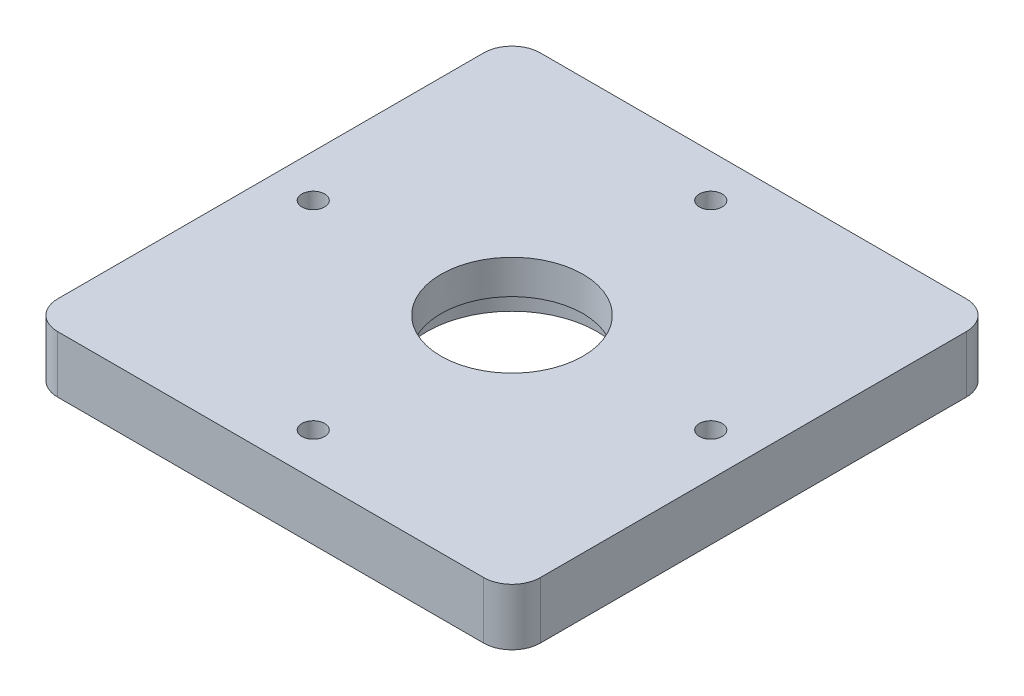
ISO-10303-21;
HEADER;
FILE_DESCRIPTION(('STEP AP214'),'2;1');
FILE_NAME('part.step','',(''),(''),'','','');
FILE_SCHEMA(('AUTOMOTIVE_DESIGN { 1 0 10303 214 1 1 1 1 }'));
ENDSEC;
DATA;
#1=APPLICATION_CONTEXT('core data for automotive mechanical design processes');
#2=APPLICATION_PROTOCOL_DEFINITION('international standard','automotive_design',2000,#1);
#3=PRODUCT_CONTEXT('',#1,'mechanical');
#4=PRODUCT('Part','Part','',(#3));
#5=PRODUCT_RELATED_PRODUCT_CATEGORY('part','',(#4));
#6=PRODUCT_DEFINITION_FORMATION('','',#4);
#7=PRODUCT_DEFINITION_CONTEXT('part definition',#1,'design');
#8=PRODUCT_DEFINITION('design','',#6,#7);
#9=PRODUCT_DEFINITION_SHAPE('','',#8);
#10=(LENGTH_UNIT() NAMED_UNIT(*) SI_UNIT(.MILLI.,.METRE.));
#11=(NAMED_UNIT(*) PLANE_ANGLE_UNIT() SI_UNIT($,.RADIAN.));
#12=(NAMED_UNIT(*) SI_UNIT($,.STERADIAN.) SOLID_ANGLE_UNIT());
#13=UNCERTAINTY_MEASURE_WITH_UNIT(LENGTH_MEASURE(1.E-05),#10,'distance_accuracy_value','');
#14=(GEOMETRIC_REPRESENTATION_CONTEXT(3) GLOBAL_UNCERTAINTY_ASSIGNED_CONTEXT((#13)) GLOBAL_UNIT_ASSIGNED_CONTEXT((#10,
#11,#12)) REPRESENTATION_CONTEXT('',''));
#15=CARTESIAN_POINT('',(0.,0.,0.));
#16=DIRECTION('',(0.,0.,1.));
#17=DIRECTION('',(1.,0.,0.));
#18=AXIS2_PLACEMENT_3D('',#15,#16,#17);
#19=CARTESIAN_POINT('',(85.,20.,-85.));
#20=DIRECTION('',(-1.,0.,0.));
#21=DIRECTION('',(0.,0.,1.));
#22=AXIS2_PLACEMENT_3D('',#19,#20,#21);
#23=PLANE('',#22);
#24=DIRECTION('',(0.,0.,-1.));
#25=VECTOR('',#24,1.);
#26=CARTESIAN_POINT('',(85.,0.,-85.));
#27=LINE('',#26,#25);
#28=CARTESIAN_POINT('',(85.,0.,75.));
#29=VERTEX_POINT('',#28);
#30=CARTESIAN_POINT('',(85.,0.,-75.));
#31=VERTEX_POINT('',#30);
#32=EDGE_CURVE('E123',#29,#31,#27,.T.);
#33=ORIENTED_EDGE('',*,*,#32,.T.);
#34=DIRECTION('',(0.,-1.,0.));
#35=VECTOR('',#34,1.);
#36=CARTESIAN_POINT('',(85.,20.,-75.));
#37=LINE('',#36,#35);
#38=CARTESIAN_POINT('',(85.,20.,-75.));
#39=VERTEX_POINT('',#38);
#40=EDGE_CURVE('E165',#31,#39,#37,.F.);
#41=ORIENTED_EDGE('',*,*,#40,.T.);
#42=DIRECTION('',(0.,0.,-1.));
#43=VECTOR('',#42,1.);
#44=CARTESIAN_POINT('',(85.,20.,-85.));
#45=LINE('',#44,#43);
#46=CARTESIAN_POINT('',(85.,20.,75.));
#47=VERTEX_POINT('',#46);
#48=EDGE_CURVE('E126',#47,#39,#45,.T.);
#49=ORIENTED_EDGE('',*,*,#48,.F.);
#50=DIRECTION('',(0.,-1.,0.));
#51=VECTOR('',#50,1.);
#52=CARTESIAN_POINT('',(85.,20.,75.));
#53=LINE('',#52,#51);
#54=EDGE_CURVE('E114',#47,#29,#53,.T.);
#55=ORIENTED_EDGE('',*,*,#54,.T.);
#56=EDGE_LOOP('',(#33,#41,#49,#55));
#57=FACE_BOUND('',#56,.T.);
#58=ADVANCED_FACE('F42',(#57),#23,.F.);
#59=CARTESIAN_POINT('',(-85.,20.,-85.));
#60=DIRECTION('',(0.,0.,1.));
#61=DIRECTION('',(1.,0.,0.));
#62=AXIS2_PLACEMENT_3D('',#59,#60,#61);
#63=PLANE('',#62);
#64=DIRECTION('',(-1.,0.,0.));
#65=VECTOR('',#64,1.);
#66=CARTESIAN_POINT('',(-85.,0.,-85.));
#67=LINE('',#66,#65);
#68=CARTESIAN_POINT('',(75.,0.,-85.));
#69=VERTEX_POINT('',#68);
#70=CARTESIAN_POINT('',(-75.,0.,-85.));
#71=VERTEX_POINT('',#70);
#72=EDGE_CURVE('E134',#69,#71,#67,.T.);
#73=ORIENTED_EDGE('',*,*,#72,.T.);
#74=DIRECTION('',(0.,-1.,0.));
#75=VECTOR('',#74,1.);
#76=CARTESIAN_POINT('',(-75.,20.,-85.));
#77=LINE('',#76,#75);
#78=CARTESIAN_POINT('',(-75.,20.,-85.));
#79=VERTEX_POINT('',#78);
#80=EDGE_CURVE('E178',#71,#79,#77,.F.);
#81=ORIENTED_EDGE('',*,*,#80,.T.);
#82=DIRECTION('',(-1.,0.,0.));
#83=VECTOR('',#82,1.);
#84=CARTESIAN_POINT('',(-85.,20.,-85.));
#85=LINE('',#84,#83);
#86=CARTESIAN_POINT('',(75.,20.,-85.));
#87=VERTEX_POINT('',#86);
#88=EDGE_CURVE('E213',#87,#79,#85,.T.);
#89=ORIENTED_EDGE('',*,*,#88,.F.);
#90=DIRECTION('',(0.,-1.,0.));
#91=VECTOR('',#90,1.);
#92=CARTESIAN_POINT('',(75.,20.,-85.));
#93=LINE('',#92,#91);
#94=EDGE_CURVE('E159',#87,#69,#93,.T.);
#95=ORIENTED_EDGE('',*,*,#94,.T.);
#96=EDGE_LOOP('',(#73,#81,#89,#95));
#97=FACE_BOUND('',#96,.T.);
#98=ADVANCED_FACE('F327',(#97),#63,.F.);
#99=CARTESIAN_POINT('',(-85.,20.,-85.));
#100=DIRECTION('',(1.,0.,0.));
#101=DIRECTION('',(0.,0.,-1.));
#102=AXIS2_PLACEMENT_3D('',#99,#100,#101);
#103=PLANE('',#102);
#104=DIRECTION('',(0.,0.,1.));
#105=VECTOR('',#104,1.);
#106=CARTESIAN_POINT('',(-85.,0.,-85.));
#107=LINE('',#106,#105);
#108=CARTESIAN_POINT('',(-85.,0.,-75.));
#109=VERTEX_POINT('',#108);
#110=CARTESIAN_POINT('',(-85.,0.,75.));
#111=VERTEX_POINT('',#110);
#112=EDGE_CURVE('E141',#109,#111,#107,.T.);
#113=ORIENTED_EDGE('',*,*,#112,.T.);
#114=DIRECTION('',(0.,-1.,0.));
#115=VECTOR('',#114,1.);
#116=CARTESIAN_POINT('',(-85.,20.,75.));
#117=LINE('',#116,#115);
#118=CARTESIAN_POINT('',(-85.,20.,75.));
#119=VERTEX_POINT('',#118);
#120=EDGE_CURVE('E52',#111,#119,#117,.F.);
#121=ORIENTED_EDGE('',*,*,#120,.T.);
#122=DIRECTION('',(0.,0.,1.));
#123=VECTOR('',#122,1.);
#124=CARTESIAN_POINT('',(-85.,20.,-85.));
#125=LINE('',#124,#123);
#126=CARTESIAN_POINT('',(-85.,20.,-75.));
#127=VERTEX_POINT('',#126);
#128=EDGE_CURVE('E210',#127,#119,#125,.T.);
#129=ORIENTED_EDGE('',*,*,#128,.F.);
#130=DIRECTION('',(0.,-1.,0.));
#131=VECTOR('',#130,1.);
#132=CARTESIAN_POINT('',(-85.,20.,-75.));
#133=LINE('',#132,#131);
#134=EDGE_CURVE('E171',#127,#109,#133,.T.);
#135=ORIENTED_EDGE('',*,*,#134,.T.);
#136=EDGE_LOOP('',(#113,#121,#129,#135));
#137=FACE_BOUND('',#136,.T.);
#138=ADVANCED_FACE('F322',(#137),#103,.F.);
#139=CARTESIAN_POINT('',(-85.,20.,85.));
#140=DIRECTION('',(0.,0.,-1.));
#141=DIRECTION('',(-1.,0.,0.));
#142=AXIS2_PLACEMENT_3D('',#139,#140,#141);
#143=PLANE('',#142);
#144=DIRECTION('',(1.,0.,0.));
#145=VECTOR('',#144,1.);
#146=CARTESIAN_POINT('',(-85.,20.,85.));
#147=LINE('',#146,#145);
#148=CARTESIAN_POINT('',(-75.,20.,85.));
#149=VERTEX_POINT('',#148);
#150=CARTESIAN_POINT('',(75.,20.,85.));
#151=VERTEX_POINT('',#150);
#152=EDGE_CURVE('E128',#149,#151,#147,.T.);
#153=ORIENTED_EDGE('',*,*,#152,.F.);
#154=DIRECTION('',(0.,-1.,0.));
#155=VECTOR('',#154,1.);
#156=CARTESIAN_POINT('',(-75.,20.,85.));
#157=LINE('',#156,#155);
#158=CARTESIAN_POINT('',(-75.,0.,85.));
#159=VERTEX_POINT('',#158);
#160=EDGE_CURVE('E184',#149,#159,#157,.T.);
#161=ORIENTED_EDGE('',*,*,#160,.T.);
#162=DIRECTION('',(1.,0.,0.));
#163=VECTOR('',#162,1.);
#164=CARTESIAN_POINT('',(-85.,0.,85.));
#165=LINE('',#164,#163);
#166=CARTESIAN_POINT('',(75.,0.,85.));
#167=VERTEX_POINT('',#166);
#168=EDGE_CURVE('E151',#159,#167,#165,.T.);
#169=ORIENTED_EDGE('',*,*,#168,.T.);
#170=DIRECTION('',(0.,-1.,0.));
#171=VECTOR('',#170,1.);
#172=CARTESIAN_POINT('',(75.,20.,85.));
#173=LINE('',#172,#171);
#174=EDGE_CURVE('E116',#167,#151,#173,.F.);
#175=ORIENTED_EDGE('',*,*,#174,.T.);
#176=EDGE_LOOP('',(#153,#161,#169,#175));
#177=FACE_BOUND('',#176,.T.);
#178=ADVANCED_FACE('F304',(#177),#143,.F.);
#179=CARTESIAN_POINT('',(0.,20.,0.));
#180=DIRECTION('',(0.,1.,0.));
#181=DIRECTION('',(0.,0.,1.));
#182=AXIS2_PLACEMENT_3D('',#179,#180,#181);
#183=PLANE('',#182);
#184=CARTESIAN_POINT('',(0.,20.,-70.));
#185=DIRECTION('',(0.,1.,0.));
#186=DIRECTION('',(0.,0.,1.));
#187=AXIS2_PLACEMENT_3D('',#184,#185,#186);
#188=CIRCLE('',#187,4.);
#189=CARTESIAN_POINT('',(0.,20.,-66.));
#190=VERTEX_POINT('',#189);
#191=EDGE_CURVE('E293',#190,#190,#188,.T.);
#192=ORIENTED_EDGE('',*,*,#191,.F.);
#193=EDGE_LOOP('',(#192));
#194=FACE_BOUND('',#193,.T.);
#195=CARTESIAN_POINT('',(0.,20.,70.));
#196=DIRECTION('',(0.,1.,0.));
#197=DIRECTION('',(0.,0.,1.));
#198=AXIS2_PLACEMENT_3D('',#195,#196,#197);
#199=CIRCLE('',#198,4.);
#200=CARTESIAN_POINT('',(0.,20.,74.));
#201=VERTEX_POINT('',#200);
#202=EDGE_CURVE('E277',#201,#201,#199,.T.);
#203=ORIENTED_EDGE('',*,*,#202,.F.);
#204=EDGE_LOOP('',(#203));
#205=FACE_BOUND('',#204,.T.);
#206=CARTESIAN_POINT('',(70.,20.,0.));
#207=DIRECTION('',(0.,1.,0.));
#208=DIRECTION('',(0.,0.,1.));
#209=AXIS2_PLACEMENT_3D('',#206,#207,#208);
#210=CIRCLE('',#209,4.);
#211=CARTESIAN_POINT('',(70.,20.,4.));
#212=VERTEX_POINT('',#211);
#213=EDGE_CURVE('E261',#212,#212,#210,.T.);
#214=ORIENTED_EDGE('',*,*,#213,.F.);
#215=EDGE_LOOP('',(#214));
#216=FACE_BOUND('',#215,.T.);
#217=CARTESIAN_POINT('',(-70.,20.,0.));
#218=DIRECTION('',(0.,1.,0.));
#219=DIRECTION('',(0.,0.,1.));
#220=AXIS2_PLACEMENT_3D('',#217,#218,#219);
#221=CIRCLE('',#220,4.);
#222=CARTESIAN_POINT('',(-70.,20.,4.));
#223=VERTEX_POINT('',#222);
#224=EDGE_CURVE('E245',#223,#223,#221,.T.);
#225=ORIENTED_EDGE('',*,*,#224,.F.);
#226=EDGE_LOOP('',(#225));
#227=FACE_BOUND('',#226,.T.);
#228=CARTESIAN_POINT('',(0.,20.,0.));
#229=DIRECTION('',(0.,1.,0.));
#230=DIRECTION('',(0.,0.,1.));
#231=AXIS2_PLACEMENT_3D('',#228,#229,#230);
#232=CIRCLE('',#231,25.);
#233=CARTESIAN_POINT('',(0.,20.,25.));
#234=VERTEX_POINT('',#233);
#235=EDGE_CURVE('E46',#234,#234,#232,.T.);
#236=ORIENTED_EDGE('',*,*,#235,.F.);
#237=EDGE_LOOP('',(#236));
#238=FACE_BOUND('',#237,.T.);
#239=ORIENTED_EDGE('',*,*,#128,.T.);
#240=CARTESIAN_POINT('',(-75.,20.,75.));
#241=DIRECTION('',(0.,1.,0.));
#242=DIRECTION('',(0.,0.,1.));
#243=AXIS2_PLACEMENT_3D('',#240,#241,#242);
#244=CIRCLE('',#243,10.);
#245=EDGE_CURVE('E11',#119,#149,#244,.T.);
#246=ORIENTED_EDGE('',*,*,#245,.T.);
#247=ORIENTED_EDGE('',*,*,#152,.T.);
#248=CARTESIAN_POINT('',(75.,20.,75.));
#249=DIRECTION('',(0.,1.,0.));
#250=DIRECTION('',(0.,0.,1.));
#251=AXIS2_PLACEMENT_3D('',#248,#249,#250);
#252=CIRCLE('',#251,10.);
#253=EDGE_CURVE('E156',#151,#47,#252,.T.);
#254=ORIENTED_EDGE('',*,*,#253,.T.);
#255=ORIENTED_EDGE('',*,*,#48,.T.);
#256=CARTESIAN_POINT('',(75.,20.,-75.));
#257=DIRECTION('',(0.,1.,0.));
#258=DIRECTION('',(0.,0.,1.));
#259=AXIS2_PLACEMENT_3D('',#256,#257,#258);
#260=CIRCLE('',#259,10.);
#261=EDGE_CURVE('E168',#39,#87,#260,.T.);
#262=ORIENTED_EDGE('',*,*,#261,.T.);
#263=ORIENTED_EDGE('',*,*,#88,.T.);
#264=CARTESIAN_POINT('',(-75.,20.,-75.));
#265=DIRECTION('',(0.,1.,0.));
#266=DIRECTION('',(0.,0.,1.));
#267=AXIS2_PLACEMENT_3D('',#264,#265,#266);
#268=CIRCLE('',#267,10.);
#269=EDGE_CURVE('E181',#79,#127,#268,.T.);
#270=ORIENTED_EDGE('',*,*,#269,.T.);
#271=EDGE_LOOP('',(#239,#246,#247,#254,#255,#262,#263,#270));
#272=FACE_BOUND('',#271,.T.);
#273=ADVANCED_FACE('F301',(#194,#205,#216,#227,#238,#272),#183,.T.);
#274=CARTESIAN_POINT('',(0.,0.,0.));
#275=DIRECTION('',(0.,1.,0.));
#276=DIRECTION('',(0.,0.,1.));
#277=AXIS2_PLACEMENT_3D('',#274,#275,#276);
#278=PLANE('',#277);
#279=CARTESIAN_POINT('',(0.,0.,-70.));
#280=DIRECTION('',(0.,1.,0.));
#281=DIRECTION('',(0.,0.,1.));
#282=AXIS2_PLACEMENT_3D('',#279,#280,#281);
#283=CIRCLE('',#282,3.);
#284=CARTESIAN_POINT('',(0.,0.,-67.));
#285=VERTEX_POINT('',#284);
#286=EDGE_CURVE('E281',#285,#285,#283,.T.);
#287=ORIENTED_EDGE('',*,*,#286,.T.);
#288=EDGE_LOOP('',(#287));
#289=FACE_BOUND('',#288,.T.);
#290=CARTESIAN_POINT('',(0.,0.,70.));
#291=DIRECTION('',(0.,1.,0.));
#292=DIRECTION('',(0.,0.,1.));
#293=AXIS2_PLACEMENT_3D('',#290,#291,#292);
#294=CIRCLE('',#293,3.);
#295=CARTESIAN_POINT('',(0.,0.,73.));
#296=VERTEX_POINT('',#295);
#297=EDGE_CURVE('E265',#296,#296,#294,.T.);
#298=ORIENTED_EDGE('',*,*,#297,.T.);
#299=EDGE_LOOP('',(#298));
#300=FACE_BOUND('',#299,.T.);
#301=CARTESIAN_POINT('',(70.,0.,0.));
#302=DIRECTION('',(0.,1.,0.));
#303=DIRECTION('',(0.,0.,1.));
#304=AXIS2_PLACEMENT_3D('',#301,#302,#303);
#305=CIRCLE('',#304,2.99999999999999);
#306=CARTESIAN_POINT('',(70.,0.,2.99999999999999));
#307=VERTEX_POINT('',#306);
#308=EDGE_CURVE('E249',#307,#307,#305,.T.);
#309=ORIENTED_EDGE('',*,*,#308,.T.);
#310=EDGE_LOOP('',(#309));
#311=FACE_BOUND('',#310,.T.);
#312=CARTESIAN_POINT('',(-70.,0.,0.));
#313=DIRECTION('',(0.,1.,0.));
#314=DIRECTION('',(0.,0.,1.));
#315=AXIS2_PLACEMENT_3D('',#312,#313,#314);
#316=CIRCLE('',#315,2.99999999999999);
#317=CARTESIAN_POINT('',(-70.,0.,2.99999999999999));
#318=VERTEX_POINT('',#317);
#319=EDGE_CURVE('E233',#318,#318,#316,.T.);
#320=ORIENTED_EDGE('',*,*,#319,.T.);
#321=EDGE_LOOP('',(#320));
#322=FACE_BOUND('',#321,.T.);
#323=CARTESIAN_POINT('',(0.,0.,0.));
#324=DIRECTION('',(0.,-1.,0.));
#325=DIRECTION('',(0.,0.,-1.));
#326=AXIS2_PLACEMENT_3D('',#323,#324,#325);
#327=CIRCLE('',#326,30.);
#328=CARTESIAN_POINT('',(0.,0.,-30.));
#329=VERTEX_POINT('',#328);
#330=EDGE_CURVE('E144',#329,#329,#327,.T.);
#331=ORIENTED_EDGE('',*,*,#330,.F.);
#332=EDGE_LOOP('',(#331));
#333=FACE_BOUND('',#332,.T.);
#334=ORIENTED_EDGE('',*,*,#168,.F.);
#335=CARTESIAN_POINT('',(-75.,0.,75.));
#336=DIRECTION('',(0.,1.,0.));
#337=DIRECTION('',(0.,0.,1.));
#338=AXIS2_PLACEMENT_3D('',#335,#336,#337);
#339=CIRCLE('',#338,10.);
#340=EDGE_CURVE('E66',#159,#111,#339,.F.);
#341=ORIENTED_EDGE('',*,*,#340,.T.);
#342=ORIENTED_EDGE('',*,*,#112,.F.);
#343=CARTESIAN_POINT('',(-75.,0.,-75.));
#344=DIRECTION('',(0.,1.,0.));
#345=DIRECTION('',(0.,0.,1.));
#346=AXIS2_PLACEMENT_3D('',#343,#344,#345);
#347=CIRCLE('',#346,10.);
#348=EDGE_CURVE('E175',#109,#71,#347,.F.);
#349=ORIENTED_EDGE('',*,*,#348,.T.);
#350=ORIENTED_EDGE('',*,*,#72,.F.);
#351=CARTESIAN_POINT('',(75.,0.,-75.));
#352=DIRECTION('',(0.,1.,0.));
#353=DIRECTION('',(0.,0.,1.));
#354=AXIS2_PLACEMENT_3D('',#351,#352,#353);
#355=CIRCLE('',#354,10.);
#356=EDGE_CURVE('E132',#69,#31,#355,.F.);
#357=ORIENTED_EDGE('',*,*,#356,.T.);
#358=ORIENTED_EDGE('',*,*,#32,.F.);
#359=CARTESIAN_POINT('',(75.,0.,75.));
#360=DIRECTION('',(0.,1.,0.));
#361=DIRECTION('',(0.,0.,1.));
#362=AXIS2_PLACEMENT_3D('',#359,#360,#361);
#363=CIRCLE('',#362,10.);
#364=EDGE_CURVE('E110',#29,#167,#363,.F.);
#365=ORIENTED_EDGE('',*,*,#364,.T.);
#366=EDGE_LOOP('',(#334,#341,#342,#349,#350,#357,#358,#365));
#367=FACE_BOUND('',#366,.T.);
#368=ADVANCED_FACE('F130',(#289,#300,#311,#322,#333,#367),#278,.F.);
#369=CARTESIAN_POINT('',(75.,20.,75.));
#370=DIRECTION('',(0.,-1.,0.));
#371=DIRECTION('',(0.,0.,-1.));
#372=AXIS2_PLACEMENT_3D('',#369,#370,#371);
#373=CYLINDRICAL_SURFACE('',#372,10.);
#374=ORIENTED_EDGE('',*,*,#253,.F.);
#375=ORIENTED_EDGE('',*,*,#174,.F.);
#376=ORIENTED_EDGE('',*,*,#364,.F.);
#377=ORIENTED_EDGE('',*,*,#54,.F.);
#378=EDGE_LOOP('',(#374,#375,#376,#377));
#379=FACE_BOUND('',#378,.T.);
#380=ADVANCED_FACE('F113',(#379),#373,.T.);
#381=CARTESIAN_POINT('',(75.,20.,-75.));
#382=DIRECTION('',(0.,-1.,0.));
#383=DIRECTION('',(0.,0.,-1.));
#384=AXIS2_PLACEMENT_3D('',#381,#382,#383);
#385=CYLINDRICAL_SURFACE('',#384,10.);
#386=ORIENTED_EDGE('',*,*,#261,.F.);
#387=ORIENTED_EDGE('',*,*,#40,.F.);
#388=ORIENTED_EDGE('',*,*,#356,.F.);
#389=ORIENTED_EDGE('',*,*,#94,.F.);
#390=EDGE_LOOP('',(#386,#387,#388,#389));
#391=FACE_BOUND('',#390,.T.);
#392=ADVANCED_FACE('F340',(#391),#385,.T.);
#393=CARTESIAN_POINT('',(-75.,20.,-75.));
#394=DIRECTION('',(0.,-1.,0.));
#395=DIRECTION('',(0.,0.,-1.));
#396=AXIS2_PLACEMENT_3D('',#393,#394,#395);
#397=CYLINDRICAL_SURFACE('',#396,10.);
#398=ORIENTED_EDGE('',*,*,#269,.F.);
#399=ORIENTED_EDGE('',*,*,#80,.F.);
#400=ORIENTED_EDGE('',*,*,#348,.F.);
#401=ORIENTED_EDGE('',*,*,#134,.F.);
#402=EDGE_LOOP('',(#398,#399,#400,#401));
#403=FACE_BOUND('',#402,.T.);
#404=ADVANCED_FACE('F342',(#403),#397,.T.);
#405=CARTESIAN_POINT('',(-75.,20.,75.));
#406=DIRECTION('',(0.,-1.,0.));
#407=DIRECTION('',(0.,0.,-1.));
#408=AXIS2_PLACEMENT_3D('',#405,#406,#407);
#409=CYLINDRICAL_SURFACE('',#408,10.);
#410=ORIENTED_EDGE('',*,*,#245,.F.);
#411=ORIENTED_EDGE('',*,*,#120,.F.);
#412=ORIENTED_EDGE('',*,*,#340,.F.);
#413=ORIENTED_EDGE('',*,*,#160,.F.);
#414=EDGE_LOOP('',(#410,#411,#412,#413));
#415=FACE_BOUND('',#414,.T.);
#416=ADVANCED_FACE('F44',(#415),#409,.T.);
#417=CARTESIAN_POINT('',(0.,8.,0.));
#418=DIRECTION('',(0.,-1.,0.));
#419=DIRECTION('',(0.,0.,-1.));
#420=AXIS2_PLACEMENT_3D('',#417,#418,#419);
#421=CYLINDRICAL_SURFACE('',#420,30.);
#422=CARTESIAN_POINT('',(0.,8.,0.));
#423=DIRECTION('',(0.,-1.,0.));
#424=DIRECTION('',(0.,0.,-1.));
#425=AXIS2_PLACEMENT_3D('',#422,#423,#424);
#426=CIRCLE('',#425,30.);
#427=CARTESIAN_POINT('',(0.,8.,-30.));
#428=VERTEX_POINT('',#427);
#429=EDGE_CURVE('E135',#428,#428,#426,.T.);
#430=ORIENTED_EDGE('',*,*,#429,.F.);
#431=EDGE_LOOP('',(#430));
#432=FACE_BOUND('',#431,.T.);
#433=ORIENTED_EDGE('',*,*,#330,.T.);
#434=EDGE_LOOP('',(#433));
#435=FACE_BOUND('',#434,.T.);
#436=ADVANCED_FACE('F349',(#432,#435),#421,.F.);
#437=CARTESIAN_POINT('',(0.,8.,0.));
#438=DIRECTION('',(0.,-1.,0.));
#439=DIRECTION('',(0.,0.,-1.));
#440=AXIS2_PLACEMENT_3D('',#437,#438,#439);
#441=PLANE('',#440);
#442=CARTESIAN_POINT('',(0.,8.,0.));
#443=DIRECTION('',(0.,-1.,0.));
#444=DIRECTION('',(0.,0.,-1.));
#445=AXIS2_PLACEMENT_3D('',#442,#443,#444);
#446=CIRCLE('',#445,25.);
#447=CARTESIAN_POINT('',(0.,8.,-25.));
#448=VERTEX_POINT('',#447);
#449=EDGE_CURVE('E229',#448,#448,#446,.T.);
#450=ORIENTED_EDGE('',*,*,#449,.F.);
#451=EDGE_LOOP('',(#450));
#452=FACE_BOUND('',#451,.T.);
#453=ORIENTED_EDGE('',*,*,#429,.T.);
#454=EDGE_LOOP('',(#453));
#455=FACE_BOUND('',#454,.T.);
#456=ADVANCED_FACE('F356',(#452,#455),#441,.T.);
#457=CARTESIAN_POINT('',(0.,104.,0.));
#458=DIRECTION('',(0.,-1.,0.));
#459=DIRECTION('',(0.,0.,-1.));
#460=AXIS2_PLACEMENT_3D('',#457,#458,#459);
#461=CYLINDRICAL_SURFACE('',#460,25.);
#462=ORIENTED_EDGE('',*,*,#235,.T.);
#463=EDGE_LOOP('',(#462));
#464=FACE_BOUND('',#463,.T.);
#465=ORIENTED_EDGE('',*,*,#449,.T.);
#466=EDGE_LOOP('',(#465));
#467=FACE_BOUND('',#466,.T.);
#468=ADVANCED_FACE('F362',(#464,#467),#461,.F.);
#469=CARTESIAN_POINT('',(-70.,20.,0.));
#470=DIRECTION('',(0.,1.,0.));
#471=DIRECTION('',(0.,0.,1.));
#472=AXIS2_PLACEMENT_3D('',#469,#470,#471);
#473=CYLINDRICAL_SURFACE('',#472,3.);
#474=ORIENTED_EDGE('',*,*,#319,.F.);
#475=EDGE_LOOP('',(#474));
#476=FACE_BOUND('',#475,.T.);
#477=CARTESIAN_POINT('',(-70.,14.,0.));
#478=DIRECTION('',(0.,1.,0.));
#479=DIRECTION('',(0.,0.,1.));
#480=AXIS2_PLACEMENT_3D('',#477,#478,#479);
#481=CIRCLE('',#480,3.);
#482=CARTESIAN_POINT('',(-70.,14.,3.));
#483=VERTEX_POINT('',#482);
#484=EDGE_CURVE('E237',#483,#483,#481,.T.);
#485=ORIENTED_EDGE('',*,*,#484,.T.);
#486=EDGE_LOOP('',(#485));
#487=FACE_BOUND('',#486,.T.);
#488=ADVANCED_FACE('F382',(#476,#487),#473,.F.);
#489=CARTESIAN_POINT('',(-67.,14.,0.));
#490=DIRECTION('',(0.,-1.,0.));
#491=DIRECTION('',(0.,0.,-1.));
#492=AXIS2_PLACEMENT_3D('',#489,#490,#491);
#493=PLANE('',#492);
#494=ORIENTED_EDGE('',*,*,#484,.F.);
#495=EDGE_LOOP('',(#494));
#496=FACE_BOUND('',#495,.T.);
#497=CARTESIAN_POINT('',(-70.,14.,0.));
#498=DIRECTION('',(0.,1.,0.));
#499=DIRECTION('',(0.,0.,1.));
#500=AXIS2_PLACEMENT_3D('',#497,#498,#499);
#501=CIRCLE('',#500,4.);
#502=CARTESIAN_POINT('',(-70.,14.,4.));
#503=VERTEX_POINT('',#502);
#504=EDGE_CURVE('E241',#503,#503,#501,.T.);
#505=ORIENTED_EDGE('',*,*,#504,.T.);
#506=EDGE_LOOP('',(#505));
#507=FACE_BOUND('',#506,.T.);
#508=ADVANCED_FACE('F385',(#496,#507),#493,.F.);
#509=CARTESIAN_POINT('',(-70.,20.,0.));
#510=DIRECTION('',(0.,1.,0.));
#511=DIRECTION('',(0.,0.,1.));
#512=AXIS2_PLACEMENT_3D('',#509,#510,#511);
#513=CYLINDRICAL_SURFACE('',#512,4.);
#514=ORIENTED_EDGE('',*,*,#504,.F.);
#515=EDGE_LOOP('',(#514));
#516=FACE_BOUND('',#515,.T.);
#517=ORIENTED_EDGE('',*,*,#224,.T.);
#518=EDGE_LOOP('',(#517));
#519=FACE_BOUND('',#518,.T.);
#520=ADVANCED_FACE('F391',(#516,#519),#513,.F.);
#521=CARTESIAN_POINT('',(70.,20.,0.));
#522=DIRECTION('',(0.,1.,0.));
#523=DIRECTION('',(0.,0.,1.));
#524=AXIS2_PLACEMENT_3D('',#521,#522,#523);
#525=CYLINDRICAL_SURFACE('',#524,3.);
#526=ORIENTED_EDGE('',*,*,#308,.F.);
#527=EDGE_LOOP('',(#526));
#528=FACE_BOUND('',#527,.T.);
#529=CARTESIAN_POINT('',(70.,14.,0.));
#530=DIRECTION('',(0.,1.,0.));
#531=DIRECTION('',(0.,0.,1.));
#532=AXIS2_PLACEMENT_3D('',#529,#530,#531);
#533=CIRCLE('',#532,3.);
#534=CARTESIAN_POINT('',(70.,14.,3.));
#535=VERTEX_POINT('',#534);
#536=EDGE_CURVE('E253',#535,#535,#533,.T.);
#537=ORIENTED_EDGE('',*,*,#536,.T.);
#538=EDGE_LOOP('',(#537));
#539=FACE_BOUND('',#538,.T.);
#540=ADVANCED_FACE('F397',(#528,#539),#525,.F.);
#541=CARTESIAN_POINT('',(73.,14.,0.));
#542=DIRECTION('',(0.,-1.,0.));
#543=DIRECTION('',(0.,0.,-1.));
#544=AXIS2_PLACEMENT_3D('',#541,#542,#543);
#545=PLANE('',#544);
#546=ORIENTED_EDGE('',*,*,#536,.F.);
#547=EDGE_LOOP('',(#546));
#548=FACE_BOUND('',#547,.T.);
#549=CARTESIAN_POINT('',(70.,14.,0.));
#550=DIRECTION('',(0.,1.,0.));
#551=DIRECTION('',(0.,0.,1.));
#552=AXIS2_PLACEMENT_3D('',#549,#550,#551);
#553=CIRCLE('',#552,4.);
#554=CARTESIAN_POINT('',(70.,14.,4.));
#555=VERTEX_POINT('',#554);
#556=EDGE_CURVE('E257',#555,#555,#553,.T.);
#557=ORIENTED_EDGE('',*,*,#556,.T.);
#558=EDGE_LOOP('',(#557));
#559=FACE_BOUND('',#558,.T.);
#560=ADVANCED_FACE('F402',(#548,#559),#545,.F.);
#561=CARTESIAN_POINT('',(70.,20.,0.));
#562=DIRECTION('',(0.,1.,0.));
#563=DIRECTION('',(0.,0.,1.));
#564=AXIS2_PLACEMENT_3D('',#561,#562,#563);
#565=CYLINDRICAL_SURFACE('',#564,4.);
#566=ORIENTED_EDGE('',*,*,#556,.F.);
#567=EDGE_LOOP('',(#566));
#568=FACE_BOUND('',#567,.T.);
#569=ORIENTED_EDGE('',*,*,#213,.T.);
#570=EDGE_LOOP('',(#569));
#571=FACE_BOUND('',#570,.T.);
#572=ADVANCED_FACE('F462',(#568,#571),#565,.F.);
#573=CARTESIAN_POINT('',(0.,20.,70.));
#574=DIRECTION('',(0.,1.,0.));
#575=DIRECTION('',(0.,0.,1.));
#576=AXIS2_PLACEMENT_3D('',#573,#574,#575);
#577=CYLINDRICAL_SURFACE('',#576,3.);
#578=ORIENTED_EDGE('',*,*,#297,.F.);
#579=EDGE_LOOP('',(#578));
#580=FACE_BOUND('',#579,.T.);
#581=CARTESIAN_POINT('',(0.,14.,70.));
#582=DIRECTION('',(0.,1.,0.));
#583=DIRECTION('',(0.,0.,1.));
#584=AXIS2_PLACEMENT_3D('',#581,#582,#583);
#585=CIRCLE('',#584,3.);
#586=CARTESIAN_POINT('',(0.,14.,73.));
#587=VERTEX_POINT('',#586);
#588=EDGE_CURVE('E269',#587,#587,#585,.T.);
#589=ORIENTED_EDGE('',*,*,#588,.T.);
#590=EDGE_LOOP('',(#589));
#591=FACE_BOUND('',#590,.T.);
#592=ADVANCED_FACE('F471',(#580,#591),#577,.F.);
#593=CARTESIAN_POINT('',(3.,14.,70.));
#594=DIRECTION('',(0.,-1.,0.));
#595=DIRECTION('',(0.,0.,-1.));
#596=AXIS2_PLACEMENT_3D('',#593,#594,#595);
#597=PLANE('',#596);
#598=ORIENTED_EDGE('',*,*,#588,.F.);
#599=EDGE_LOOP('',(#598));
#600=FACE_BOUND('',#599,.T.);
#601=CARTESIAN_POINT('',(0.,14.,70.));
#602=DIRECTION('',(0.,1.,0.));
#603=DIRECTION('',(0.,0.,1.));
#604=AXIS2_PLACEMENT_3D('',#601,#602,#603);
#605=CIRCLE('',#604,4.);
#606=CARTESIAN_POINT('',(0.,14.,74.));
#607=VERTEX_POINT('',#606);
#608=EDGE_CURVE('E273',#607,#607,#605,.T.);
#609=ORIENTED_EDGE('',*,*,#608,.T.);
#610=EDGE_LOOP('',(#609));
#611=FACE_BOUND('',#610,.T.);
#612=ADVANCED_FACE('F481',(#600,#611),#597,.F.);
#613=CARTESIAN_POINT('',(0.,20.,70.));
#614=DIRECTION('',(0.,1.,0.));
#615=DIRECTION('',(0.,0.,1.));
#616=AXIS2_PLACEMENT_3D('',#613,#614,#615);
#617=CYLINDRICAL_SURFACE('',#616,4.);
#618=ORIENTED_EDGE('',*,*,#608,.F.);
#619=EDGE_LOOP('',(#618));
#620=FACE_BOUND('',#619,.T.);
#621=ORIENTED_EDGE('',*,*,#202,.T.);
#622=EDGE_LOOP('',(#621));
#623=FACE_BOUND('',#622,.T.);
#624=ADVANCED_FACE('F491',(#620,#623),#617,.F.);
#625=CARTESIAN_POINT('',(0.,20.,-70.));
#626=DIRECTION('',(0.,1.,0.));
#627=DIRECTION('',(0.,0.,1.));
#628=AXIS2_PLACEMENT_3D('',#625,#626,#627);
#629=CYLINDRICAL_SURFACE('',#628,3.);
#630=ORIENTED_EDGE('',*,*,#286,.F.);
#631=EDGE_LOOP('',(#630));
#632=FACE_BOUND('',#631,.T.);
#633=CARTESIAN_POINT('',(0.,14.,-70.));
#634=DIRECTION('',(0.,1.,0.));
#635=DIRECTION('',(0.,0.,1.));
#636=AXIS2_PLACEMENT_3D('',#633,#634,#635);
#637=CIRCLE('',#636,3.);
#638=CARTESIAN_POINT('',(0.,14.,-67.));
#639=VERTEX_POINT('',#638);
#640=EDGE_CURVE('E285',#639,#639,#637,.T.);
#641=ORIENTED_EDGE('',*,*,#640,.T.);
#642=EDGE_LOOP('',(#641));
#643=FACE_BOUND('',#642,.T.);
#644=ADVANCED_FACE('F501',(#632,#643),#629,.F.);
#645=CARTESIAN_POINT('',(3.,14.,-70.));
#646=DIRECTION('',(0.,-1.,0.));
#647=DIRECTION('',(0.,0.,-1.));
#648=AXIS2_PLACEMENT_3D('',#645,#646,#647);
#649=PLANE('',#648);
#650=ORIENTED_EDGE('',*,*,#640,.F.);
#651=EDGE_LOOP('',(#650));
#652=FACE_BOUND('',#651,.T.);
#653=CARTESIAN_POINT('',(0.,14.,-70.));
#654=DIRECTION('',(0.,1.,0.));
#655=DIRECTION('',(0.,0.,1.));
#656=AXIS2_PLACEMENT_3D('',#653,#654,#655);
#657=CIRCLE('',#656,4.);
#658=CARTESIAN_POINT('',(0.,14.,-66.));
#659=VERTEX_POINT('',#658);
#660=EDGE_CURVE('E289',#659,#659,#657,.T.);
#661=ORIENTED_EDGE('',*,*,#660,.T.);
#662=EDGE_LOOP('',(#661));
#663=FACE_BOUND('',#662,.T.);
#664=ADVANCED_FACE('F511',(#652,#663),#649,.F.);
#665=CARTESIAN_POINT('',(0.,20.,-70.));
#666=DIRECTION('',(0.,1.,0.));
#667=DIRECTION('',(0.,0.,1.));
#668=AXIS2_PLACEMENT_3D('',#665,#666,#667);
#669=CYLINDRICAL_SURFACE('',#668,4.);
#670=ORIENTED_EDGE('',*,*,#660,.F.);
#671=EDGE_LOOP('',(#670));
#672=FACE_BOUND('',#671,.T.);
#673=ORIENTED_EDGE('',*,*,#191,.T.);
#674=EDGE_LOOP('',(#673));
#675=FACE_BOUND('',#674,.T.);
#676=ADVANCED_FACE('F299',(#672,#675),#669,.F.);
#677=CLOSED_SHELL('',(#58,#98,#138,#178,#273,#368,#380,#392,#404,#416,#436,#456,#468,#488,#508,
#520,#540,#560,#572,#592,#612,#624,#644,#664,#676));
#678=MANIFOLD_SOLID_BREP('B2',#677);
#679=ADVANCED_BREP_SHAPE_REPRESENTATION('',(#18,#678),#14);
#680=SHAPE_DEFINITION_REPRESENTATION(#9,#679);
ENDSEC;
END-ISO-10303-21;
